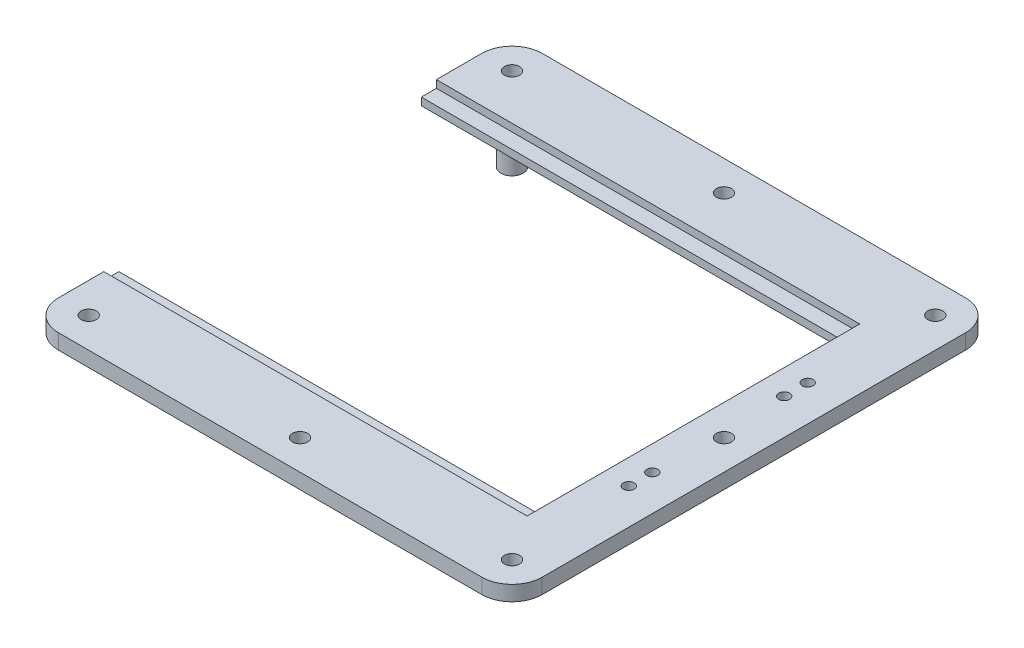
ISO-10303-21;
HEADER;
FILE_DESCRIPTION(('STEP AP214'),'2;1');
FILE_NAME('part.step','',(''),(''),'','','');
FILE_SCHEMA(('AUTOMOTIVE_DESIGN { 1 0 10303 214 1 1 1 1 }'));
ENDSEC;
DATA;
#1=APPLICATION_CONTEXT('core data for automotive mechanical design processes');
#2=APPLICATION_PROTOCOL_DEFINITION('international standard','automotive_design',2000,#1);
#3=PRODUCT_CONTEXT('',#1,'mechanical');
#4=PRODUCT('Part','Part','',(#3));
#5=PRODUCT_RELATED_PRODUCT_CATEGORY('part','',(#4));
#6=PRODUCT_DEFINITION_FORMATION('','',#4);
#7=PRODUCT_DEFINITION_CONTEXT('part definition',#1,'design');
#8=PRODUCT_DEFINITION('design','',#6,#7);
#9=PRODUCT_DEFINITION_SHAPE('','',#8);
#10=(LENGTH_UNIT() NAMED_UNIT(*) SI_UNIT(.MILLI.,.METRE.));
#11=(NAMED_UNIT(*) PLANE_ANGLE_UNIT() SI_UNIT($,.RADIAN.));
#12=(NAMED_UNIT(*) SI_UNIT($,.STERADIAN.) SOLID_ANGLE_UNIT());
#13=UNCERTAINTY_MEASURE_WITH_UNIT(LENGTH_MEASURE(1.E-05),#10,'distance_accuracy_value','');
#14=(GEOMETRIC_REPRESENTATION_CONTEXT(3) GLOBAL_UNCERTAINTY_ASSIGNED_CONTEXT((#13)) GLOBAL_UNIT_ASSIGNED_CONTEXT((#10,
#11,#12)) REPRESENTATION_CONTEXT('',''));
#15=CARTESIAN_POINT('',(0.,0.,0.));
#16=DIRECTION('',(0.,0.,1.));
#17=DIRECTION('',(1.,0.,0.));
#18=AXIS2_PLACEMENT_3D('',#15,#16,#17);
#19=CARTESIAN_POINT('',(177.8,6.35,0.));
#20=DIRECTION('',(0.,0.,-1.));
#21=DIRECTION('',(-1.,0.,0.));
#22=AXIS2_PLACEMENT_3D('',#19,#20,#21);
#23=PLANE('',#22);
#24=DIRECTION('',(0.,-1.,0.));
#25=VECTOR('',#24,1.);
#26=CARTESIAN_POINT('',(177.8,6.35,0.));
#27=LINE('',#26,#25);
#28=CARTESIAN_POINT('',(177.8,3.175,0.));
#29=VERTEX_POINT('',#28);
#30=CARTESIAN_POINT('',(177.8,0.,0.));
#31=VERTEX_POINT('',#30);
#32=EDGE_CURVE('E11',#29,#31,#27,.T.);
#33=ORIENTED_EDGE('',*,*,#32,.F.);
#34=DIRECTION('',(1.,0.,0.));
#35=VECTOR('',#34,1.);
#36=CARTESIAN_POINT('',(177.8,3.175,0.));
#37=LINE('',#36,#35);
#38=CARTESIAN_POINT('',(1.08197495753343E-13,3.175,0.));
#39=VERTEX_POINT('',#38);
#40=EDGE_CURVE('E310',#39,#29,#37,.T.);
#41=ORIENTED_EDGE('',*,*,#40,.F.);
#42=DIRECTION('',(0.,-1.,0.));
#43=VECTOR('',#42,1.);
#44=CARTESIAN_POINT('',(0.,6.35,0.));
#45=LINE('',#44,#43);
#46=CARTESIAN_POINT('',(0.,0.,0.));
#47=VERTEX_POINT('',#46);
#48=EDGE_CURVE('E109',#39,#47,#45,.T.);
#49=ORIENTED_EDGE('',*,*,#48,.T.);
#50=DIRECTION('',(1.,0.,0.));
#51=VECTOR('',#50,1.);
#52=CARTESIAN_POINT('',(177.8,0.,0.));
#53=LINE('',#52,#51);
#54=EDGE_CURVE('E169',#47,#31,#53,.T.);
#55=ORIENTED_EDGE('',*,*,#54,.T.);
#56=EDGE_LOOP('',(#33,#41,#49,#55));
#57=FACE_BOUND('',#56,.T.);
#58=ADVANCED_FACE('F38',(#57),#23,.F.);
#59=CARTESIAN_POINT('',(177.8,6.35,127.));
#60=DIRECTION('',(1.,0.,0.));
#61=DIRECTION('',(0.,0.,-1.));
#62=AXIS2_PLACEMENT_3D('',#59,#60,#61);
#63=PLANE('',#62);
#64=DIRECTION('',(0.,0.,1.));
#65=VECTOR('',#64,1.);
#66=CARTESIAN_POINT('',(177.8,0.,127.));
#67=LINE('',#66,#65);
#68=CARTESIAN_POINT('',(177.8,0.,127.));
#69=VERTEX_POINT('',#68);
#70=EDGE_CURVE('E172',#31,#69,#67,.T.);
#71=ORIENTED_EDGE('',*,*,#70,.T.);
#72=DIRECTION('',(0.,-1.,0.));
#73=VECTOR('',#72,1.);
#74=CARTESIAN_POINT('',(177.8,6.35,127.));
#75=LINE('',#74,#73);
#76=CARTESIAN_POINT('',(177.8,3.175,127.));
#77=VERTEX_POINT('',#76);
#78=EDGE_CURVE('E47',#77,#69,#75,.T.);
#79=ORIENTED_EDGE('',*,*,#78,.F.);
#80=DIRECTION('',(0.,0.,-1.));
#81=VECTOR('',#80,1.);
#82=CARTESIAN_POINT('',(177.8,3.175,127.));
#83=LINE('',#82,#81);
#84=CARTESIAN_POINT('',(177.8,3.175,133.35));
#85=VERTEX_POINT('',#84);
#86=EDGE_CURVE('E283',#85,#77,#83,.T.);
#87=ORIENTED_EDGE('',*,*,#86,.F.);
#88=DIRECTION('',(0.,1.,0.));
#89=VECTOR('',#88,1.);
#90=CARTESIAN_POINT('',(177.8,3.175,133.35));
#91=LINE('',#90,#89);
#92=CARTESIAN_POINT('',(177.8,6.35,133.35));
#93=VERTEX_POINT('',#92);
#94=EDGE_CURVE('E303',#85,#93,#91,.T.);
#95=ORIENTED_EDGE('',*,*,#94,.T.);
#96=DIRECTION('',(0.,0.,1.));
#97=VECTOR('',#96,1.);
#98=CARTESIAN_POINT('',(177.8,6.35,127.));
#99=LINE('',#98,#97);
#100=CARTESIAN_POINT('',(177.8,6.35,-6.35000000000002));
#101=VERTEX_POINT('',#100);
#102=EDGE_CURVE('E207',#101,#93,#99,.T.);
#103=ORIENTED_EDGE('',*,*,#102,.F.);
#104=DIRECTION('',(0.,1.,0.));
#105=VECTOR('',#104,1.);
#106=CARTESIAN_POINT('',(177.8,3.175,-6.35000000000002));
#107=LINE('',#106,#105);
#108=CARTESIAN_POINT('',(177.8,3.175,-6.35000000000002));
#109=VERTEX_POINT('',#108);
#110=EDGE_CURVE('E326',#109,#101,#107,.T.);
#111=ORIENTED_EDGE('',*,*,#110,.F.);
#112=DIRECTION('',(0.,0.,-1.));
#113=VECTOR('',#112,1.);
#114=CARTESIAN_POINT('',(177.8,3.175,0.));
#115=LINE('',#114,#113);
#116=EDGE_CURVE('E314',#29,#109,#115,.T.);
#117=ORIENTED_EDGE('',*,*,#116,.F.);
#118=ORIENTED_EDGE('',*,*,#32,.T.);
#119=EDGE_LOOP('',(#71,#79,#87,#95,#103,#111,#117,#118));
#120=FACE_BOUND('',#119,.T.);
#121=ADVANCED_FACE('F474',(#120),#63,.F.);
#122=CARTESIAN_POINT('',(0.,6.35,127.));
#123=DIRECTION('',(0.,0.,1.));
#124=DIRECTION('',(1.,0.,0.));
#125=AXIS2_PLACEMENT_3D('',#122,#123,#124);
#126=PLANE('',#125);
#127=DIRECTION('',(0.,-1.,0.));
#128=VECTOR('',#127,1.);
#129=CARTESIAN_POINT('',(0.,6.35,127.));
#130=LINE('',#129,#128);
#131=CARTESIAN_POINT('',(0.,3.175,127.));
#132=VERTEX_POINT('',#131);
#133=CARTESIAN_POINT('',(0.,0.,127.));
#134=VERTEX_POINT('',#133);
#135=EDGE_CURVE('E234',#132,#134,#130,.T.);
#136=ORIENTED_EDGE('',*,*,#135,.F.);
#137=DIRECTION('',(-1.,0.,0.));
#138=VECTOR('',#137,1.);
#139=CARTESIAN_POINT('',(177.8,3.175,127.));
#140=LINE('',#139,#138);
#141=EDGE_CURVE('E287',#77,#132,#140,.T.);
#142=ORIENTED_EDGE('',*,*,#141,.F.);
#143=ORIENTED_EDGE('',*,*,#78,.T.);
#144=DIRECTION('',(-1.,0.,0.));
#145=VECTOR('',#144,1.);
#146=CARTESIAN_POINT('',(0.,0.,127.));
#147=LINE('',#146,#145);
#148=EDGE_CURVE('E177',#69,#134,#147,.T.);
#149=ORIENTED_EDGE('',*,*,#148,.T.);
#150=EDGE_LOOP('',(#136,#142,#143,#149));
#151=FACE_BOUND('',#150,.T.);
#152=ADVANCED_FACE('F478',(#151),#126,.F.);
#153=CARTESIAN_POINT('',(0.,6.35,152.4));
#154=DIRECTION('',(1.,0.,0.));
#155=DIRECTION('',(0.,0.,-1.));
#156=AXIS2_PLACEMENT_3D('',#153,#154,#155);
#157=PLANE('',#156);
#158=DIRECTION('',(0.,0.,1.));
#159=VECTOR('',#158,1.);
#160=CARTESIAN_POINT('',(0.,6.35,152.4));
#161=LINE('',#160,#159);
#162=CARTESIAN_POINT('',(0.,6.35,133.35));
#163=VERTEX_POINT('',#162);
#164=CARTESIAN_POINT('',(0.,6.35,152.4));
#165=VERTEX_POINT('',#164);
#166=EDGE_CURVE('E116',#163,#165,#161,.T.);
#167=ORIENTED_EDGE('',*,*,#166,.F.);
#168=DIRECTION('',(0.,1.,0.));
#169=VECTOR('',#168,1.);
#170=CARTESIAN_POINT('',(0.,3.175,133.35));
#171=LINE('',#170,#169);
#172=CARTESIAN_POINT('',(0.,3.175,133.35));
#173=VERTEX_POINT('',#172);
#174=EDGE_CURVE('E55',#173,#163,#171,.T.);
#175=ORIENTED_EDGE('',*,*,#174,.F.);
#176=DIRECTION('',(0.,0.,1.));
#177=VECTOR('',#176,1.);
#178=CARTESIAN_POINT('',(0.,3.175,127.));
#179=LINE('',#178,#177);
#180=EDGE_CURVE('E292',#132,#173,#179,.T.);
#181=ORIENTED_EDGE('',*,*,#180,.F.);
#182=ORIENTED_EDGE('',*,*,#135,.T.);
#183=DIRECTION('',(0.,0.,1.));
#184=VECTOR('',#183,1.);
#185=CARTESIAN_POINT('',(0.,0.,152.4));
#186=LINE('',#185,#184);
#187=CARTESIAN_POINT('',(0.,0.,152.4));
#188=VERTEX_POINT('',#187);
#189=EDGE_CURVE('E181',#134,#188,#186,.T.);
#190=ORIENTED_EDGE('',*,*,#189,.T.);
#191=DIRECTION('',(0.,-1.,0.));
#192=VECTOR('',#191,1.);
#193=CARTESIAN_POINT('',(0.,6.35,152.4));
#194=LINE('',#193,#192);
#195=EDGE_CURVE('E230',#165,#188,#194,.T.);
#196=ORIENTED_EDGE('',*,*,#195,.F.);
#197=EDGE_LOOP('',(#167,#175,#181,#182,#190,#196));
#198=FACE_BOUND('',#197,.T.);
#199=ADVANCED_FACE('F805',(#198),#157,.F.);
#200=CARTESIAN_POINT('',(12.7,6.35,152.4));
#201=DIRECTION('',(0.,-1.,0.));
#202=DIRECTION('',(0.,0.,-1.));
#203=AXIS2_PLACEMENT_3D('',#200,#201,#202);
#204=CYLINDRICAL_SURFACE('',#203,12.7);
#205=CARTESIAN_POINT('',(12.7,0.,152.4));
#206=DIRECTION('',(0.,1.,0.));
#207=DIRECTION('',(0.,0.,-1.));
#208=AXIS2_PLACEMENT_3D('',#205,#206,#207);
#209=CIRCLE('',#208,12.7);
#210=CARTESIAN_POINT('',(12.7000000000001,0.,165.1));
#211=VERTEX_POINT('',#210);
#212=EDGE_CURVE('E184',#188,#211,#209,.T.);
#213=ORIENTED_EDGE('',*,*,#212,.T.);
#214=DIRECTION('',(0.,-1.,0.));
#215=VECTOR('',#214,1.);
#216=CARTESIAN_POINT('',(12.7000000000001,6.35,165.1));
#217=LINE('',#216,#215);
#218=CARTESIAN_POINT('',(12.7000000000001,6.35,165.1));
#219=VERTEX_POINT('',#218);
#220=EDGE_CURVE('E226',#219,#211,#217,.T.);
#221=ORIENTED_EDGE('',*,*,#220,.F.);
#222=CARTESIAN_POINT('',(12.7,6.35,152.4));
#223=DIRECTION('',(0.,1.,0.));
#224=DIRECTION('',(0.,0.,-1.));
#225=AXIS2_PLACEMENT_3D('',#222,#223,#224);
#226=CIRCLE('',#225,12.7);
#227=EDGE_CURVE('E402',#165,#219,#226,.T.);
#228=ORIENTED_EDGE('',*,*,#227,.F.);
#229=ORIENTED_EDGE('',*,*,#195,.T.);
#230=EDGE_LOOP('',(#213,#221,#228,#229));
#231=FACE_BOUND('',#230,.T.);
#232=ADVANCED_FACE('F813',(#231),#204,.T.);
#233=CARTESIAN_POINT('',(190.5,6.35,165.1));
#234=DIRECTION('',(0.,0.,-1.));
#235=DIRECTION('',(-1.,0.,0.));
#236=AXIS2_PLACEMENT_3D('',#233,#234,#235);
#237=PLANE('',#236);
#238=DIRECTION('',(1.,0.,0.));
#239=VECTOR('',#238,1.);
#240=CARTESIAN_POINT('',(190.5,0.,165.1));
#241=LINE('',#240,#239);
#242=CARTESIAN_POINT('',(190.5,0.,165.1));
#243=VERTEX_POINT('',#242);
#244=EDGE_CURVE('E187',#211,#243,#241,.T.);
#245=ORIENTED_EDGE('',*,*,#244,.T.);
#246=DIRECTION('',(0.,-1.,0.));
#247=VECTOR('',#246,1.);
#248=CARTESIAN_POINT('',(190.5,6.35,165.1));
#249=LINE('',#248,#247);
#250=CARTESIAN_POINT('',(190.5,6.35,165.1));
#251=VERTEX_POINT('',#250);
#252=EDGE_CURVE('E222',#251,#243,#249,.T.);
#253=ORIENTED_EDGE('',*,*,#252,.F.);
#254=DIRECTION('',(1.,0.,0.));
#255=VECTOR('',#254,1.);
#256=CARTESIAN_POINT('',(190.5,6.35,165.1));
#257=LINE('',#256,#255);
#258=EDGE_CURVE('E405',#219,#251,#257,.T.);
#259=ORIENTED_EDGE('',*,*,#258,.F.);
#260=ORIENTED_EDGE('',*,*,#220,.T.);
#261=EDGE_LOOP('',(#245,#253,#259,#260));
#262=FACE_BOUND('',#261,.T.);
#263=ADVANCED_FACE('F824',(#262),#237,.F.);
#264=CARTESIAN_POINT('',(190.5,6.35,152.4));
#265=DIRECTION('',(0.,-1.,0.));
#266=DIRECTION('',(0.,0.,-1.));
#267=AXIS2_PLACEMENT_3D('',#264,#265,#266);
#268=CYLINDRICAL_SURFACE('',#267,12.7);
#269=CARTESIAN_POINT('',(190.5,0.,152.4));
#270=DIRECTION('',(0.,1.,0.));
#271=DIRECTION('',(0.,0.,-1.));
#272=AXIS2_PLACEMENT_3D('',#269,#270,#271);
#273=CIRCLE('',#272,12.7);
#274=CARTESIAN_POINT('',(203.2,0.,152.4));
#275=VERTEX_POINT('',#274);
#276=EDGE_CURVE('E190',#243,#275,#273,.T.);
#277=ORIENTED_EDGE('',*,*,#276,.T.);
#278=DIRECTION('',(0.,-1.,0.));
#279=VECTOR('',#278,1.);
#280=CARTESIAN_POINT('',(203.2,6.35,152.4));
#281=LINE('',#280,#279);
#282=CARTESIAN_POINT('',(203.2,6.35,152.4));
#283=VERTEX_POINT('',#282);
#284=EDGE_CURVE('E218',#283,#275,#281,.T.);
#285=ORIENTED_EDGE('',*,*,#284,.F.);
#286=CARTESIAN_POINT('',(190.5,6.35,152.4));
#287=DIRECTION('',(0.,1.,0.));
#288=DIRECTION('',(0.,0.,-1.));
#289=AXIS2_PLACEMENT_3D('',#286,#287,#288);
#290=CIRCLE('',#289,12.7);
#291=EDGE_CURVE('E408',#251,#283,#290,.T.);
#292=ORIENTED_EDGE('',*,*,#291,.F.);
#293=ORIENTED_EDGE('',*,*,#252,.T.);
#294=EDGE_LOOP('',(#277,#285,#292,#293));
#295=FACE_BOUND('',#294,.T.);
#296=ADVANCED_FACE('F831',(#295),#268,.T.);
#297=CARTESIAN_POINT('',(203.2,6.35,-25.3999999999999));
#298=DIRECTION('',(-1.,0.,0.));
#299=DIRECTION('',(0.,0.,1.));
#300=AXIS2_PLACEMENT_3D('',#297,#298,#299);
#301=PLANE('',#300);
#302=DIRECTION('',(0.,0.,-1.));
#303=VECTOR('',#302,1.);
#304=CARTESIAN_POINT('',(203.2,0.,-25.3999999999999));
#305=LINE('',#304,#303);
#306=CARTESIAN_POINT('',(203.2,0.,-25.3999999999999));
#307=VERTEX_POINT('',#306);
#308=EDGE_CURVE('E193',#275,#307,#305,.T.);
#309=ORIENTED_EDGE('',*,*,#308,.T.);
#310=DIRECTION('',(0.,-1.,0.));
#311=VECTOR('',#310,1.);
#312=CARTESIAN_POINT('',(203.2,6.35,-25.3999999999999));
#313=LINE('',#312,#311);
#314=CARTESIAN_POINT('',(203.2,6.35,-25.3999999999999));
#315=VERTEX_POINT('',#314);
#316=EDGE_CURVE('E155',#315,#307,#313,.T.);
#317=ORIENTED_EDGE('',*,*,#316,.F.);
#318=DIRECTION('',(0.,0.,-1.));
#319=VECTOR('',#318,1.);
#320=CARTESIAN_POINT('',(203.2,6.35,-25.3999999999999));
#321=LINE('',#320,#319);
#322=EDGE_CURVE('E141',#283,#315,#321,.T.);
#323=ORIENTED_EDGE('',*,*,#322,.F.);
#324=ORIENTED_EDGE('',*,*,#284,.T.);
#325=EDGE_LOOP('',(#309,#317,#323,#324));
#326=FACE_BOUND('',#325,.T.);
#327=ADVANCED_FACE('F839',(#326),#301,.F.);
#328=CARTESIAN_POINT('',(190.5,6.35,-25.4));
#329=DIRECTION('',(0.,-1.,0.));
#330=DIRECTION('',(0.,0.,-1.));
#331=AXIS2_PLACEMENT_3D('',#328,#329,#330);
#332=CYLINDRICAL_SURFACE('',#331,12.7);
#333=CARTESIAN_POINT('',(190.5,0.,-25.4));
#334=DIRECTION('',(0.,1.,0.));
#335=DIRECTION('',(0.,0.,-1.));
#336=AXIS2_PLACEMENT_3D('',#333,#334,#335);
#337=CIRCLE('',#336,12.7);
#338=CARTESIAN_POINT('',(190.5,0.,-38.1));
#339=VERTEX_POINT('',#338);
#340=EDGE_CURVE('E151',#307,#339,#337,.T.);
#341=ORIENTED_EDGE('',*,*,#340,.T.);
#342=DIRECTION('',(0.,-1.,0.));
#343=VECTOR('',#342,1.);
#344=CARTESIAN_POINT('',(190.5,6.35,-38.1));
#345=LINE('',#344,#343);
#346=CARTESIAN_POINT('',(190.5,6.35,-38.1));
#347=VERTEX_POINT('',#346);
#348=EDGE_CURVE('E148',#347,#339,#345,.T.);
#349=ORIENTED_EDGE('',*,*,#348,.F.);
#350=CARTESIAN_POINT('',(190.5,6.35,-25.4));
#351=DIRECTION('',(0.,1.,0.));
#352=DIRECTION('',(0.,0.,-1.));
#353=AXIS2_PLACEMENT_3D('',#350,#351,#352);
#354=CIRCLE('',#353,12.7);
#355=EDGE_CURVE('E133',#315,#347,#354,.T.);
#356=ORIENTED_EDGE('',*,*,#355,.F.);
#357=ORIENTED_EDGE('',*,*,#316,.T.);
#358=EDGE_LOOP('',(#341,#349,#356,#357));
#359=FACE_BOUND('',#358,.T.);
#360=ADVANCED_FACE('F149',(#359),#332,.T.);
#361=CARTESIAN_POINT('',(12.7000000000001,6.35,-38.1));
#362=DIRECTION('',(0.,0.,1.));
#363=DIRECTION('',(1.,0.,0.));
#364=AXIS2_PLACEMENT_3D('',#361,#362,#363);
#365=PLANE('',#364);
#366=DIRECTION('',(-1.,0.,0.));
#367=VECTOR('',#366,1.);
#368=CARTESIAN_POINT('',(12.7000000000001,0.,-38.1));
#369=LINE('',#368,#367);
#370=CARTESIAN_POINT('',(12.7,0.,-38.1));
#371=VERTEX_POINT('',#370);
#372=EDGE_CURVE('E198',#339,#371,#369,.T.);
#373=ORIENTED_EDGE('',*,*,#372,.T.);
#374=DIRECTION('',(0.,-1.,0.));
#375=VECTOR('',#374,1.);
#376=CARTESIAN_POINT('',(12.7,6.35,-38.1));
#377=LINE('',#376,#375);
#378=CARTESIAN_POINT('',(12.7,6.35,-38.1));
#379=VERTEX_POINT('',#378);
#380=EDGE_CURVE('E156',#379,#371,#377,.T.);
#381=ORIENTED_EDGE('',*,*,#380,.F.);
#382=DIRECTION('',(-1.,0.,0.));
#383=VECTOR('',#382,1.);
#384=CARTESIAN_POINT('',(12.7000000000001,6.35,-38.1));
#385=LINE('',#384,#383);
#386=EDGE_CURVE('E138',#347,#379,#385,.T.);
#387=ORIENTED_EDGE('',*,*,#386,.F.);
#388=ORIENTED_EDGE('',*,*,#348,.T.);
#389=EDGE_LOOP('',(#373,#381,#387,#388));
#390=FACE_BOUND('',#389,.T.);
#391=ADVANCED_FACE('F158',(#390),#365,.F.);
#392=CARTESIAN_POINT('',(12.7,6.35,-25.4));
#393=DIRECTION('',(0.,-1.,0.));
#394=DIRECTION('',(0.,0.,-1.));
#395=AXIS2_PLACEMENT_3D('',#392,#393,#394);
#396=CYLINDRICAL_SURFACE('',#395,12.7);
#397=CARTESIAN_POINT('',(12.7,0.,-25.4));
#398=DIRECTION('',(0.,1.,0.));
#399=DIRECTION('',(0.,0.,-1.));
#400=AXIS2_PLACEMENT_3D('',#397,#398,#399);
#401=CIRCLE('',#400,12.7);
#402=CARTESIAN_POINT('',(0.,0.,-25.3999999999999));
#403=VERTEX_POINT('',#402);
#404=EDGE_CURVE('E201',#371,#403,#401,.T.);
#405=ORIENTED_EDGE('',*,*,#404,.T.);
#406=DIRECTION('',(0.,-1.,0.));
#407=VECTOR('',#406,1.);
#408=CARTESIAN_POINT('',(0.,6.35,-25.3999999999999));
#409=LINE('',#408,#407);
#410=CARTESIAN_POINT('',(0.,6.35,-25.3999999999999));
#411=VERTEX_POINT('',#410);
#412=EDGE_CURVE('E210',#411,#403,#409,.T.);
#413=ORIENTED_EDGE('',*,*,#412,.F.);
#414=CARTESIAN_POINT('',(12.7,6.35,-25.4));
#415=DIRECTION('',(0.,1.,0.));
#416=DIRECTION('',(0.,0.,-1.));
#417=AXIS2_PLACEMENT_3D('',#414,#415,#416);
#418=CIRCLE('',#417,12.7);
#419=EDGE_CURVE('E64',#379,#411,#418,.T.);
#420=ORIENTED_EDGE('',*,*,#419,.F.);
#421=ORIENTED_EDGE('',*,*,#380,.T.);
#422=EDGE_LOOP('',(#405,#413,#420,#421));
#423=FACE_BOUND('',#422,.T.);
#424=ADVANCED_FACE('F860',(#423),#396,.T.);
#425=CARTESIAN_POINT('',(0.,6.35,0.));
#426=DIRECTION('',(1.,0.,0.));
#427=DIRECTION('',(0.,0.,-1.));
#428=AXIS2_PLACEMENT_3D('',#425,#426,#427);
#429=PLANE('',#428);
#430=DIRECTION('',(0.,0.,1.));
#431=VECTOR('',#430,1.);
#432=CARTESIAN_POINT('',(1.08197495753343E-13,3.175,0.));
#433=LINE('',#432,#431);
#434=CARTESIAN_POINT('',(1.06356398157764E-13,3.175,-6.35000000000005));
#435=VERTEX_POINT('',#434);
#436=EDGE_CURVE('E322',#435,#39,#433,.T.);
#437=ORIENTED_EDGE('',*,*,#436,.F.);
#438=DIRECTION('',(0.,1.,0.));
#439=VECTOR('',#438,1.);
#440=CARTESIAN_POINT('',(1.06356398157764E-13,3.175,-6.35000000000005));
#441=LINE('',#440,#439);
#442=CARTESIAN_POINT('',(1.06356398157764E-13,6.35,-6.35000000000005));
#443=VERTEX_POINT('',#442);
#444=EDGE_CURVE('E302',#435,#443,#441,.T.);
#445=ORIENTED_EDGE('',*,*,#444,.T.);
#446=DIRECTION('',(0.,0.,1.));
#447=VECTOR('',#446,1.);
#448=CARTESIAN_POINT('',(0.,6.35,0.));
#449=LINE('',#448,#447);
#450=EDGE_CURVE('E163',#411,#443,#449,.T.);
#451=ORIENTED_EDGE('',*,*,#450,.F.);
#452=ORIENTED_EDGE('',*,*,#412,.T.);
#453=DIRECTION('',(0.,0.,1.));
#454=VECTOR('',#453,1.);
#455=CARTESIAN_POINT('',(0.,0.,0.));
#456=LINE('',#455,#454);
#457=EDGE_CURVE('E204',#403,#47,#456,.T.);
#458=ORIENTED_EDGE('',*,*,#457,.T.);
#459=ORIENTED_EDGE('',*,*,#48,.F.);
#460=EDGE_LOOP('',(#437,#445,#451,#452,#458,#459));
#461=FACE_BOUND('',#460,.T.);
#462=ADVANCED_FACE('F436',(#461),#429,.F.);
#463=CARTESIAN_POINT('',(12.7,6.35,-25.4));
#464=DIRECTION('',(0.,-1.,0.));
#465=DIRECTION('',(0.,0.,-1.));
#466=AXIS2_PLACEMENT_3D('',#463,#464,#465);
#467=PLANE('',#466);
#468=CARTESIAN_POINT('',(101.6,6.35,-25.527));
#469=DIRECTION('',(0.,1.,0.));
#470=DIRECTION('',(0.,0.,1.));
#471=AXIS2_PLACEMENT_3D('',#468,#469,#470);
#472=CIRCLE('',#471,3.175);
#473=CARTESIAN_POINT('',(101.6,6.35,-22.352));
#474=VERTEX_POINT('',#473);
#475=EDGE_CURVE('E261',#474,#474,#472,.T.);
#476=ORIENTED_EDGE('',*,*,#475,.F.);
#477=EDGE_LOOP('',(#476));
#478=FACE_BOUND('',#477,.T.);
#479=CARTESIAN_POINT('',(190.627000000001,6.35,63.4999999999985));
#480=DIRECTION('',(0.,1.,0.));
#481=DIRECTION('',(0.,0.,1.));
#482=AXIS2_PLACEMENT_3D('',#479,#480,#481);
#483=CIRCLE('',#482,3.17499999999997);
#484=CARTESIAN_POINT('',(190.627000000001,6.35,66.6749999999985));
#485=VERTEX_POINT('',#484);
#486=EDGE_CURVE('E423',#485,#485,#483,.T.);
#487=ORIENTED_EDGE('',*,*,#486,.F.);
#488=EDGE_LOOP('',(#487));
#489=FACE_BOUND('',#488,.T.);
#490=CARTESIAN_POINT('',(101.600000000003,6.35,152.527));
#491=DIRECTION('',(0.,1.,0.));
#492=DIRECTION('',(0.,0.,1.));
#493=AXIS2_PLACEMENT_3D('',#490,#491,#492);
#494=CIRCLE('',#493,3.175);
#495=CARTESIAN_POINT('',(101.600000000003,6.35,155.702));
#496=VERTEX_POINT('',#495);
#497=EDGE_CURVE('E419',#496,#496,#494,.T.);
#498=ORIENTED_EDGE('',*,*,#497,.F.);
#499=EDGE_LOOP('',(#498));
#500=FACE_BOUND('',#499,.T.);
#501=CARTESIAN_POINT('',(188.214,6.35,101.092));
#502=DIRECTION('',(0.,1.,0.));
#503=DIRECTION('',(0.,0.,1.));
#504=AXIS2_PLACEMENT_3D('',#501,#502,#503);
#505=CIRCLE('',#504,2.28600000000001);
#506=CARTESIAN_POINT('',(188.214,6.35,103.378));
#507=VERTEX_POINT('',#506);
#508=EDGE_CURVE('E244',#507,#507,#505,.T.);
#509=ORIENTED_EDGE('',*,*,#508,.F.);
#510=EDGE_LOOP('',(#509));
#511=FACE_BOUND('',#510,.T.);
#512=CARTESIAN_POINT('',(188.214,6.35,91.186));
#513=DIRECTION('',(0.,1.,0.));
#514=DIRECTION('',(0.,0.,1.));
#515=AXIS2_PLACEMENT_3D('',#512,#513,#514);
#516=CIRCLE('',#515,2.28600000000001);
#517=CARTESIAN_POINT('',(188.214,6.35,93.472));
#518=VERTEX_POINT('',#517);
#519=EDGE_CURVE('E279',#518,#518,#516,.T.);
#520=ORIENTED_EDGE('',*,*,#519,.F.);
#521=EDGE_LOOP('',(#520));
#522=FACE_BOUND('',#521,.T.);
#523=CARTESIAN_POINT('',(188.214,6.35,35.814));
#524=DIRECTION('',(0.,1.,0.));
#525=DIRECTION('',(0.,0.,1.));
#526=AXIS2_PLACEMENT_3D('',#523,#524,#525);
#527=CIRCLE('',#526,2.28600000000001);
#528=CARTESIAN_POINT('',(188.214,6.35,38.1));
#529=VERTEX_POINT('',#528);
#530=EDGE_CURVE('E273',#529,#529,#527,.T.);
#531=ORIENTED_EDGE('',*,*,#530,.F.);
#532=EDGE_LOOP('',(#531));
#533=FACE_BOUND('',#532,.T.);
#534=CARTESIAN_POINT('',(188.214,6.35,25.908));
#535=DIRECTION('',(0.,1.,0.));
#536=DIRECTION('',(0.,0.,1.));
#537=AXIS2_PLACEMENT_3D('',#534,#535,#536);
#538=CIRCLE('',#537,2.28600000000001);
#539=CARTESIAN_POINT('',(188.214,6.35,28.194));
#540=VERTEX_POINT('',#539);
#541=EDGE_CURVE('E268',#540,#540,#538,.T.);
#542=ORIENTED_EDGE('',*,*,#541,.F.);
#543=EDGE_LOOP('',(#542));
#544=FACE_BOUND('',#543,.T.);
#545=CARTESIAN_POINT('',(12.7,6.35,152.4));
#546=DIRECTION('',(0.,1.,0.));
#547=DIRECTION('',(0.,0.,1.));
#548=AXIS2_PLACEMENT_3D('',#545,#546,#547);
#549=CIRCLE('',#548,3.175);
#550=CARTESIAN_POINT('',(12.7,6.35,155.575));
#551=VERTEX_POINT('',#550);
#552=EDGE_CURVE('E364',#551,#551,#549,.T.);
#553=ORIENTED_EDGE('',*,*,#552,.F.);
#554=EDGE_LOOP('',(#553));
#555=FACE_BOUND('',#554,.T.);
#556=CARTESIAN_POINT('',(190.5,6.35,152.4));
#557=DIRECTION('',(0.,1.,0.));
#558=DIRECTION('',(0.,0.,1.));
#559=AXIS2_PLACEMENT_3D('',#556,#557,#558);
#560=CIRCLE('',#559,3.175);
#561=CARTESIAN_POINT('',(190.5,6.35,155.575));
#562=VERTEX_POINT('',#561);
#563=EDGE_CURVE('E381',#562,#562,#560,.T.);
#564=ORIENTED_EDGE('',*,*,#563,.F.);
#565=EDGE_LOOP('',(#564));
#566=FACE_BOUND('',#565,.T.);
#567=CARTESIAN_POINT('',(190.5,6.35,-25.4));
#568=DIRECTION('',(0.,1.,0.));
#569=DIRECTION('',(0.,0.,1.));
#570=AXIS2_PLACEMENT_3D('',#567,#568,#569);
#571=CIRCLE('',#570,3.175);
#572=CARTESIAN_POINT('',(190.5,6.35,-22.225));
#573=VERTEX_POINT('',#572);
#574=EDGE_CURVE('E373',#573,#573,#571,.T.);
#575=ORIENTED_EDGE('',*,*,#574,.F.);
#576=EDGE_LOOP('',(#575));
#577=FACE_BOUND('',#576,.T.);
#578=CARTESIAN_POINT('',(12.7,6.35,-25.4));
#579=DIRECTION('',(0.,1.,0.));
#580=DIRECTION('',(0.,0.,1.));
#581=AXIS2_PLACEMENT_3D('',#578,#579,#580);
#582=CIRCLE('',#581,3.175);
#583=CARTESIAN_POINT('',(12.7,6.35,-22.225));
#584=VERTEX_POINT('',#583);
#585=EDGE_CURVE('E372',#584,#584,#582,.T.);
#586=ORIENTED_EDGE('',*,*,#585,.F.);
#587=EDGE_LOOP('',(#586));
#588=FACE_BOUND('',#587,.T.);
#589=ORIENTED_EDGE('',*,*,#102,.T.);
#590=DIRECTION('',(1.,0.,0.));
#591=VECTOR('',#590,1.);
#592=CARTESIAN_POINT('',(177.8,6.35,133.35));
#593=LINE('',#592,#591);
#594=EDGE_CURVE('E288',#163,#93,#593,.T.);
#595=ORIENTED_EDGE('',*,*,#594,.F.);
#596=ORIENTED_EDGE('',*,*,#166,.T.);
#597=ORIENTED_EDGE('',*,*,#227,.T.);
#598=ORIENTED_EDGE('',*,*,#258,.T.);
#599=ORIENTED_EDGE('',*,*,#291,.T.);
#600=ORIENTED_EDGE('',*,*,#322,.T.);
#601=ORIENTED_EDGE('',*,*,#355,.T.);
#602=ORIENTED_EDGE('',*,*,#386,.T.);
#603=ORIENTED_EDGE('',*,*,#419,.T.);
#604=ORIENTED_EDGE('',*,*,#450,.T.);
#605=DIRECTION('',(-1.,0.,0.));
#606=VECTOR('',#605,1.);
#607=CARTESIAN_POINT('',(177.8,6.35,-6.35000000000002));
#608=LINE('',#607,#606);
#609=EDGE_CURVE('E256',#101,#443,#608,.T.);
#610=ORIENTED_EDGE('',*,*,#609,.F.);
#611=EDGE_LOOP('',(#589,#595,#596,#597,#598,#599,#600,#601,#602,#603,#604,#610));
#612=FACE_BOUND('',#611,.T.);
#613=ADVANCED_FACE('F136',(#478,#489,#500,#511,#522,#533,#544,#555,#566,#577,#588,#612),#467,.F.);
#614=CARTESIAN_POINT('',(12.7,0.,-25.4));
#615=DIRECTION('',(0.,-1.,0.));
#616=DIRECTION('',(0.,0.,-1.));
#617=AXIS2_PLACEMENT_3D('',#614,#615,#616);
#618=PLANE('',#617);
#619=CARTESIAN_POINT('',(101.6,0.,-25.527));
#620=DIRECTION('',(0.,-1.,0.));
#621=DIRECTION('',(0.,0.,-1.));
#622=AXIS2_PLACEMENT_3D('',#619,#620,#621);
#623=CIRCLE('',#622,3.175);
#624=CARTESIAN_POINT('',(101.6,0.,-28.702));
#625=VERTEX_POINT('',#624);
#626=EDGE_CURVE('E41',#625,#625,#623,.T.);
#627=ORIENTED_EDGE('',*,*,#626,.F.);
#628=EDGE_LOOP('',(#627));
#629=FACE_BOUND('',#628,.T.);
#630=CARTESIAN_POINT('',(190.627000000001,0.,63.4999999999985));
#631=DIRECTION('',(0.,-1.,0.));
#632=DIRECTION('',(0.,0.,-1.));
#633=AXIS2_PLACEMENT_3D('',#630,#631,#632);
#634=CIRCLE('',#633,3.17499999999997);
#635=CARTESIAN_POINT('',(190.627000000001,0.,60.3249999999986));
#636=VERTEX_POINT('',#635);
#637=EDGE_CURVE('E260',#636,#636,#634,.T.);
#638=ORIENTED_EDGE('',*,*,#637,.F.);
#639=EDGE_LOOP('',(#638));
#640=FACE_BOUND('',#639,.T.);
#641=CARTESIAN_POINT('',(101.600000000003,0.,152.527));
#642=DIRECTION('',(0.,-1.,0.));
#643=DIRECTION('',(0.,0.,-1.));
#644=AXIS2_PLACEMENT_3D('',#641,#642,#643);
#645=CIRCLE('',#644,3.175);
#646=CARTESIAN_POINT('',(101.600000000003,0.,149.352));
#647=VERTEX_POINT('',#646);
#648=EDGE_CURVE('E257',#647,#647,#645,.T.);
#649=ORIENTED_EDGE('',*,*,#648,.F.);
#650=EDGE_LOOP('',(#649));
#651=FACE_BOUND('',#650,.T.);
#652=CARTESIAN_POINT('',(188.214,0.,101.092));
#653=DIRECTION('',(0.,-1.,0.));
#654=DIRECTION('',(0.,0.,-1.));
#655=AXIS2_PLACEMENT_3D('',#652,#653,#654);
#656=CIRCLE('',#655,2.28600000000001);
#657=CARTESIAN_POINT('',(188.214,0.,98.806));
#658=VERTEX_POINT('',#657);
#659=EDGE_CURVE('E252',#658,#658,#656,.T.);
#660=ORIENTED_EDGE('',*,*,#659,.F.);
#661=EDGE_LOOP('',(#660));
#662=FACE_BOUND('',#661,.T.);
#663=CARTESIAN_POINT('',(188.214,0.,91.186));
#664=DIRECTION('',(0.,-1.,0.));
#665=DIRECTION('',(0.,0.,-1.));
#666=AXIS2_PLACEMENT_3D('',#663,#664,#665);
#667=CIRCLE('',#666,2.28600000000001);
#668=CARTESIAN_POINT('',(188.214,0.,88.9));
#669=VERTEX_POINT('',#668);
#670=EDGE_CURVE('E248',#669,#669,#667,.T.);
#671=ORIENTED_EDGE('',*,*,#670,.F.);
#672=EDGE_LOOP('',(#671));
#673=FACE_BOUND('',#672,.T.);
#674=CARTESIAN_POINT('',(188.214,0.,35.814));
#675=DIRECTION('',(0.,-1.,0.));
#676=DIRECTION('',(0.,0.,-1.));
#677=AXIS2_PLACEMENT_3D('',#674,#675,#676);
#678=CIRCLE('',#677,2.28600000000001);
#679=CARTESIAN_POINT('',(188.214,0.,33.528));
#680=VERTEX_POINT('',#679);
#681=EDGE_CURVE('E243',#680,#680,#678,.T.);
#682=ORIENTED_EDGE('',*,*,#681,.F.);
#683=EDGE_LOOP('',(#682));
#684=FACE_BOUND('',#683,.T.);
#685=CARTESIAN_POINT('',(188.214,0.,25.908));
#686=DIRECTION('',(0.,-1.,0.));
#687=DIRECTION('',(0.,0.,-1.));
#688=AXIS2_PLACEMENT_3D('',#685,#686,#687);
#689=CIRCLE('',#688,2.28600000000001);
#690=CARTESIAN_POINT('',(188.214,0.,23.622));
#691=VERTEX_POINT('',#690);
#692=EDGE_CURVE('E239',#691,#691,#689,.T.);
#693=ORIENTED_EDGE('',*,*,#692,.F.);
#694=EDGE_LOOP('',(#693));
#695=FACE_BOUND('',#694,.T.);
#696=CARTESIAN_POINT('',(28.5750000000001,0.,-9.52500000000006));
#697=DIRECTION('',(0.,-1.,0.));
#698=DIRECTION('',(0.,0.,1.));
#699=AXIS2_PLACEMENT_3D('',#696,#697,#698);
#700=CIRCLE('',#699,4.6625);
#701=CARTESIAN_POINT('',(28.5750000000001,0.,-4.86250000000006));
#702=VERTEX_POINT('',#701);
#703=EDGE_CURVE('E307',#702,#702,#700,.T.);
#704=ORIENTED_EDGE('',*,*,#703,.F.);
#705=EDGE_LOOP('',(#704));
#706=FACE_BOUND('',#705,.T.);
#707=CARTESIAN_POINT('',(174.625,0.,-9.52500000000006));
#708=DIRECTION('',(0.,-1.,0.));
#709=DIRECTION('',(0.,0.,1.));
#710=AXIS2_PLACEMENT_3D('',#707,#708,#709);
#711=CIRCLE('',#710,4.66249999999996);
#712=CARTESIAN_POINT('',(174.625,0.,-4.8625000000001));
#713=VERTEX_POINT('',#712);
#714=EDGE_CURVE('E340',#713,#713,#711,.T.);
#715=ORIENTED_EDGE('',*,*,#714,.F.);
#716=EDGE_LOOP('',(#715));
#717=FACE_BOUND('',#716,.T.);
#718=CARTESIAN_POINT('',(174.625,0.,136.525));
#719=DIRECTION('',(0.,-1.,0.));
#720=DIRECTION('',(0.,0.,-1.));
#721=AXIS2_PLACEMENT_3D('',#718,#719,#720);
#722=CIRCLE('',#721,4.66249999999999);
#723=CARTESIAN_POINT('',(174.625,0.,131.8625));
#724=VERTEX_POINT('',#723);
#725=EDGE_CURVE('E348',#724,#724,#722,.T.);
#726=ORIENTED_EDGE('',*,*,#725,.F.);
#727=EDGE_LOOP('',(#726));
#728=FACE_BOUND('',#727,.T.);
#729=CARTESIAN_POINT('',(28.575,0.,136.525));
#730=DIRECTION('',(0.,-1.,0.));
#731=DIRECTION('',(0.,0.,-1.));
#732=AXIS2_PLACEMENT_3D('',#729,#730,#731);
#733=CIRCLE('',#732,4.6625);
#734=CARTESIAN_POINT('',(28.575,0.,131.8625));
#735=VERTEX_POINT('',#734);
#736=EDGE_CURVE('E356',#735,#735,#733,.T.);
#737=ORIENTED_EDGE('',*,*,#736,.F.);
#738=EDGE_LOOP('',(#737));
#739=FACE_BOUND('',#738,.T.);
#740=CARTESIAN_POINT('',(12.7,0.,152.4));
#741=DIRECTION('',(0.,1.,0.));
#742=DIRECTION('',(0.,0.,1.));
#743=AXIS2_PLACEMENT_3D('',#740,#741,#742);
#744=CIRCLE('',#743,3.175);
#745=CARTESIAN_POINT('',(12.7,0.,155.575));
#746=VERTEX_POINT('',#745);
#747=EDGE_CURVE('E385',#746,#746,#744,.T.);
#748=ORIENTED_EDGE('',*,*,#747,.T.);
#749=EDGE_LOOP('',(#748));
#750=FACE_BOUND('',#749,.T.);
#751=CARTESIAN_POINT('',(190.5,0.,152.4));
#752=DIRECTION('',(0.,1.,0.));
#753=DIRECTION('',(0.,0.,1.));
#754=AXIS2_PLACEMENT_3D('',#751,#752,#753);
#755=CIRCLE('',#754,3.175);
#756=CARTESIAN_POINT('',(190.5,0.,155.575));
#757=VERTEX_POINT('',#756);
#758=EDGE_CURVE('E377',#757,#757,#755,.T.);
#759=ORIENTED_EDGE('',*,*,#758,.T.);
#760=EDGE_LOOP('',(#759));
#761=FACE_BOUND('',#760,.T.);
#762=CARTESIAN_POINT('',(190.5,0.,-25.4));
#763=DIRECTION('',(0.,1.,0.));
#764=DIRECTION('',(0.,0.,1.));
#765=AXIS2_PLACEMENT_3D('',#762,#763,#764);
#766=CIRCLE('',#765,3.175);
#767=CARTESIAN_POINT('',(190.5,0.,-22.225));
#768=VERTEX_POINT('',#767);
#769=EDGE_CURVE('E368',#768,#768,#766,.T.);
#770=ORIENTED_EDGE('',*,*,#769,.T.);
#771=EDGE_LOOP('',(#770));
#772=FACE_BOUND('',#771,.T.);
#773=CARTESIAN_POINT('',(12.7,0.,-25.4));
#774=DIRECTION('',(0.,1.,0.));
#775=DIRECTION('',(0.,0.,1.));
#776=AXIS2_PLACEMENT_3D('',#773,#774,#775);
#777=CIRCLE('',#776,3.175);
#778=CARTESIAN_POINT('',(12.7,0.,-22.225));
#779=VERTEX_POINT('',#778);
#780=EDGE_CURVE('E173',#779,#779,#777,.T.);
#781=ORIENTED_EDGE('',*,*,#780,.T.);
#782=EDGE_LOOP('',(#781));
#783=FACE_BOUND('',#782,.T.);
#784=ORIENTED_EDGE('',*,*,#54,.F.);
#785=ORIENTED_EDGE('',*,*,#457,.F.);
#786=ORIENTED_EDGE('',*,*,#404,.F.);
#787=ORIENTED_EDGE('',*,*,#372,.F.);
#788=ORIENTED_EDGE('',*,*,#340,.F.);
#789=ORIENTED_EDGE('',*,*,#308,.F.);
#790=ORIENTED_EDGE('',*,*,#276,.F.);
#791=ORIENTED_EDGE('',*,*,#244,.F.);
#792=ORIENTED_EDGE('',*,*,#212,.F.);
#793=ORIENTED_EDGE('',*,*,#189,.F.);
#794=ORIENTED_EDGE('',*,*,#148,.F.);
#795=ORIENTED_EDGE('',*,*,#70,.F.);
#796=EDGE_LOOP('',(#784,#785,#786,#787,#788,#789,#790,#791,#792,#793,#794,#795));
#797=FACE_BOUND('',#796,.T.);
#798=ADVANCED_FACE('F435',(#629,#640,#651,#662,#673,#684,#695,#706,#717,#728,#739,#750,#761,
#772,#783,#797),#618,.T.);
#799=CARTESIAN_POINT('',(12.7,0.,-25.4));
#800=DIRECTION('',(0.,1.,0.));
#801=DIRECTION('',(0.,0.,1.));
#802=AXIS2_PLACEMENT_3D('',#799,#800,#801);
#803=CYLINDRICAL_SURFACE('',#802,3.175);
#804=ORIENTED_EDGE('',*,*,#780,.F.);
#805=EDGE_LOOP('',(#804));
#806=FACE_BOUND('',#805,.T.);
#807=ORIENTED_EDGE('',*,*,#585,.T.);
#808=EDGE_LOOP('',(#807));
#809=FACE_BOUND('',#808,.T.);
#810=ADVANCED_FACE('F456',(#806,#809),#803,.F.);
#811=CARTESIAN_POINT('',(190.5,0.,-25.4));
#812=DIRECTION('',(0.,1.,0.));
#813=DIRECTION('',(0.,0.,1.));
#814=AXIS2_PLACEMENT_3D('',#811,#812,#813);
#815=CYLINDRICAL_SURFACE('',#814,3.175);
#816=ORIENTED_EDGE('',*,*,#769,.F.);
#817=EDGE_LOOP('',(#816));
#818=FACE_BOUND('',#817,.T.);
#819=ORIENTED_EDGE('',*,*,#574,.T.);
#820=EDGE_LOOP('',(#819));
#821=FACE_BOUND('',#820,.T.);
#822=ADVANCED_FACE('F458',(#818,#821),#815,.F.);
#823=CARTESIAN_POINT('',(190.5,0.,152.4));
#824=DIRECTION('',(0.,1.,0.));
#825=DIRECTION('',(0.,0.,1.));
#826=AXIS2_PLACEMENT_3D('',#823,#824,#825);
#827=CYLINDRICAL_SURFACE('',#826,3.175);
#828=ORIENTED_EDGE('',*,*,#758,.F.);
#829=EDGE_LOOP('',(#828));
#830=FACE_BOUND('',#829,.T.);
#831=ORIENTED_EDGE('',*,*,#563,.T.);
#832=EDGE_LOOP('',(#831));
#833=FACE_BOUND('',#832,.T.);
#834=ADVANCED_FACE('F465',(#830,#833),#827,.F.);
#835=CARTESIAN_POINT('',(12.7,0.,152.4));
#836=DIRECTION('',(0.,1.,0.));
#837=DIRECTION('',(0.,0.,1.));
#838=AXIS2_PLACEMENT_3D('',#835,#836,#837);
#839=CYLINDRICAL_SURFACE('',#838,3.175);
#840=ORIENTED_EDGE('',*,*,#747,.F.);
#841=EDGE_LOOP('',(#840));
#842=FACE_BOUND('',#841,.T.);
#843=ORIENTED_EDGE('',*,*,#552,.T.);
#844=EDGE_LOOP('',(#843));
#845=FACE_BOUND('',#844,.T.);
#846=ADVANCED_FACE('F568',(#842,#845),#839,.F.);
#847=CARTESIAN_POINT('',(28.575,-12.7,136.525));
#848=DIRECTION('',(0.,1.,0.));
#849=DIRECTION('',(0.,0.,1.));
#850=AXIS2_PLACEMENT_3D('',#847,#848,#849);
#851=CYLINDRICAL_SURFACE('',#850,4.6625);
#852=CARTESIAN_POINT('',(28.575,-12.7,136.525));
#853=DIRECTION('',(0.,-1.,0.));
#854=DIRECTION('',(0.,0.,-1.));
#855=AXIS2_PLACEMENT_3D('',#852,#853,#854);
#856=CIRCLE('',#855,4.6625);
#857=CARTESIAN_POINT('',(28.575,-12.7,131.8625));
#858=VERTEX_POINT('',#857);
#859=EDGE_CURVE('E360',#858,#858,#856,.T.);
#860=ORIENTED_EDGE('',*,*,#859,.F.);
#861=EDGE_LOOP('',(#860));
#862=FACE_BOUND('',#861,.T.);
#863=ORIENTED_EDGE('',*,*,#736,.T.);
#864=EDGE_LOOP('',(#863));
#865=FACE_BOUND('',#864,.T.);
#866=ADVANCED_FACE('F565',(#862,#865),#851,.T.);
#867=CARTESIAN_POINT('',(28.575,-12.7,136.525));
#868=DIRECTION('',(0.,-1.,0.));
#869=DIRECTION('',(0.,0.,-1.));
#870=AXIS2_PLACEMENT_3D('',#867,#868,#869);
#871=PLANE('',#870);
#872=ORIENTED_EDGE('',*,*,#859,.T.);
#873=EDGE_LOOP('',(#872));
#874=FACE_BOUND('',#873,.T.);
#875=ADVANCED_FACE('F561',(#874),#871,.T.);
#876=CARTESIAN_POINT('',(174.625,-12.7,136.525));
#877=DIRECTION('',(0.,1.,0.));
#878=DIRECTION('',(0.,0.,1.));
#879=AXIS2_PLACEMENT_3D('',#876,#877,#878);
#880=CYLINDRICAL_SURFACE('',#879,4.66249999999999);
#881=CARTESIAN_POINT('',(174.625,-12.7,136.525));
#882=DIRECTION('',(0.,-1.,0.));
#883=DIRECTION('',(0.,0.,-1.));
#884=AXIS2_PLACEMENT_3D('',#881,#882,#883);
#885=CIRCLE('',#884,4.66249999999999);
#886=CARTESIAN_POINT('',(174.625,-12.7,131.8625));
#887=VERTEX_POINT('',#886);
#888=EDGE_CURVE('E352',#887,#887,#885,.T.);
#889=ORIENTED_EDGE('',*,*,#888,.F.);
#890=EDGE_LOOP('',(#889));
#891=FACE_BOUND('',#890,.T.);
#892=ORIENTED_EDGE('',*,*,#725,.T.);
#893=EDGE_LOOP('',(#892));
#894=FACE_BOUND('',#893,.T.);
#895=ADVANCED_FACE('F557',(#891,#894),#880,.T.);
#896=CARTESIAN_POINT('',(174.625,-12.7,136.525));
#897=DIRECTION('',(0.,-1.,0.));
#898=DIRECTION('',(0.,0.,-1.));
#899=AXIS2_PLACEMENT_3D('',#896,#897,#898);
#900=PLANE('',#899);
#901=ORIENTED_EDGE('',*,*,#888,.T.);
#902=EDGE_LOOP('',(#901));
#903=FACE_BOUND('',#902,.T.);
#904=ADVANCED_FACE('F553',(#903),#900,.T.);
#905=CARTESIAN_POINT('',(174.625,-12.7,-9.52500000000006));
#906=DIRECTION('',(0.,1.,0.));
#907=DIRECTION('',(0.,0.,1.));
#908=AXIS2_PLACEMENT_3D('',#905,#906,#907);
#909=CYLINDRICAL_SURFACE('',#908,4.66249999999996);
#910=CARTESIAN_POINT('',(174.625,-12.7,-9.52500000000006));
#911=DIRECTION('',(0.,-1.,0.));
#912=DIRECTION('',(0.,0.,1.));
#913=AXIS2_PLACEMENT_3D('',#910,#911,#912);
#914=CIRCLE('',#913,4.66249999999996);
#915=CARTESIAN_POINT('',(174.625,-12.7,-4.8625000000001));
#916=VERTEX_POINT('',#915);
#917=EDGE_CURVE('E344',#916,#916,#914,.T.);
#918=ORIENTED_EDGE('',*,*,#917,.F.);
#919=EDGE_LOOP('',(#918));
#920=FACE_BOUND('',#919,.T.);
#921=ORIENTED_EDGE('',*,*,#714,.T.);
#922=EDGE_LOOP('',(#921));
#923=FACE_BOUND('',#922,.T.);
#924=ADVANCED_FACE('F549',(#920,#923),#909,.T.);
#925=CARTESIAN_POINT('',(174.625,-12.7,-9.52500000000006));
#926=DIRECTION('',(0.,1.,0.));
#927=DIRECTION('',(0.,0.,1.));
#928=AXIS2_PLACEMENT_3D('',#925,#926,#927);
#929=PLANE('',#928);
#930=ORIENTED_EDGE('',*,*,#917,.T.);
#931=EDGE_LOOP('',(#930));
#932=FACE_BOUND('',#931,.T.);
#933=ADVANCED_FACE('F545',(#932),#929,.F.);
#934=CARTESIAN_POINT('',(28.5750000000001,-12.7,-9.52500000000006));
#935=DIRECTION('',(0.,1.,0.));
#936=DIRECTION('',(0.,0.,1.));
#937=AXIS2_PLACEMENT_3D('',#934,#935,#936);
#938=CYLINDRICAL_SURFACE('',#937,4.6625);
#939=CARTESIAN_POINT('',(28.5750000000001,-12.7,-9.52500000000006));
#940=DIRECTION('',(0.,-1.,0.));
#941=DIRECTION('',(0.,0.,1.));
#942=AXIS2_PLACEMENT_3D('',#939,#940,#941);
#943=CIRCLE('',#942,4.6625);
#944=CARTESIAN_POINT('',(28.5750000000001,-12.7,-4.86250000000006));
#945=VERTEX_POINT('',#944);
#946=EDGE_CURVE('E336',#945,#945,#943,.T.);
#947=ORIENTED_EDGE('',*,*,#946,.F.);
#948=EDGE_LOOP('',(#947));
#949=FACE_BOUND('',#948,.T.);
#950=ORIENTED_EDGE('',*,*,#703,.T.);
#951=EDGE_LOOP('',(#950));
#952=FACE_BOUND('',#951,.T.);
#953=ADVANCED_FACE('F541',(#949,#952),#938,.T.);
#954=CARTESIAN_POINT('',(28.5750000000001,-12.7,-9.52500000000006));
#955=DIRECTION('',(0.,1.,0.));
#956=DIRECTION('',(0.,0.,1.));
#957=AXIS2_PLACEMENT_3D('',#954,#955,#956);
#958=PLANE('',#957);
#959=ORIENTED_EDGE('',*,*,#946,.T.);
#960=EDGE_LOOP('',(#959));
#961=FACE_BOUND('',#960,.T.);
#962=ADVANCED_FACE('F535',(#961),#958,.F.);
#963=CARTESIAN_POINT('',(177.8,3.175,-6.35000000000002));
#964=DIRECTION('',(0.,0.,-1.));
#965=DIRECTION('',(-1.,0.,0.));
#966=AXIS2_PLACEMENT_3D('',#963,#964,#965);
#967=PLANE('',#966);
#968=ORIENTED_EDGE('',*,*,#609,.T.);
#969=ORIENTED_EDGE('',*,*,#444,.F.);
#970=DIRECTION('',(-1.,0.,0.));
#971=VECTOR('',#970,1.);
#972=CARTESIAN_POINT('',(177.8,3.175,-6.35000000000002));
#973=LINE('',#972,#971);
#974=EDGE_CURVE('E318',#109,#435,#973,.T.);
#975=ORIENTED_EDGE('',*,*,#974,.F.);
#976=ORIENTED_EDGE('',*,*,#110,.T.);
#977=EDGE_LOOP('',(#968,#969,#975,#976));
#978=FACE_BOUND('',#977,.T.);
#979=ADVANCED_FACE('F519',(#978),#967,.F.);
#980=CARTESIAN_POINT('',(0.,3.175,0.));
#981=DIRECTION('',(0.,-1.,0.));
#982=DIRECTION('',(0.,0.,-1.));
#983=AXIS2_PLACEMENT_3D('',#980,#981,#982);
#984=PLANE('',#983);
#985=ORIENTED_EDGE('',*,*,#40,.T.);
#986=ORIENTED_EDGE('',*,*,#116,.T.);
#987=ORIENTED_EDGE('',*,*,#974,.T.);
#988=ORIENTED_EDGE('',*,*,#436,.T.);
#989=EDGE_LOOP('',(#985,#986,#987,#988));
#990=FACE_BOUND('',#989,.T.);
#991=ADVANCED_FACE('F525',(#990),#984,.F.);
#992=CARTESIAN_POINT('',(177.8,3.175,133.35));
#993=DIRECTION('',(0.,0.,1.));
#994=DIRECTION('',(1.,0.,0.));
#995=AXIS2_PLACEMENT_3D('',#992,#993,#994);
#996=PLANE('',#995);
#997=ORIENTED_EDGE('',*,*,#594,.T.);
#998=ORIENTED_EDGE('',*,*,#94,.F.);
#999=DIRECTION('',(1.,0.,0.));
#1000=VECTOR('',#999,1.);
#1001=CARTESIAN_POINT('',(177.8,3.175,133.35));
#1002=LINE('',#1001,#1000);
#1003=EDGE_CURVE('E296',#173,#85,#1002,.T.);
#1004=ORIENTED_EDGE('',*,*,#1003,.F.);
#1005=ORIENTED_EDGE('',*,*,#174,.T.);
#1006=EDGE_LOOP('',(#997,#998,#1004,#1005));
#1007=FACE_BOUND('',#1006,.T.);
#1008=ADVANCED_FACE('F527',(#1007),#996,.F.);
#1009=CARTESIAN_POINT('',(0.,3.175,0.));
#1010=DIRECTION('',(0.,-1.,0.));
#1011=DIRECTION('',(0.,0.,-1.));
#1012=AXIS2_PLACEMENT_3D('',#1009,#1010,#1011);
#1013=PLANE('',#1012);
#1014=ORIENTED_EDGE('',*,*,#86,.T.);
#1015=ORIENTED_EDGE('',*,*,#141,.T.);
#1016=ORIENTED_EDGE('',*,*,#180,.T.);
#1017=ORIENTED_EDGE('',*,*,#1003,.T.);
#1018=EDGE_LOOP('',(#1014,#1015,#1016,#1017));
#1019=FACE_BOUND('',#1018,.T.);
#1020=ADVANCED_FACE('F533',(#1019),#1013,.F.);
#1021=CARTESIAN_POINT('',(188.214,-6.35,25.908));
#1022=DIRECTION('',(0.,1.,0.));
#1023=DIRECTION('',(0.,0.,1.));
#1024=AXIS2_PLACEMENT_3D('',#1021,#1022,#1023);
#1025=CYLINDRICAL_SURFACE('',#1024,2.28600000000001);
#1026=ORIENTED_EDGE('',*,*,#692,.T.);
#1027=EDGE_LOOP('',(#1026));
#1028=FACE_BOUND('',#1027,.T.);
#1029=ORIENTED_EDGE('',*,*,#541,.T.);
#1030=EDGE_LOOP('',(#1029));
#1031=FACE_BOUND('',#1030,.T.);
#1032=ADVANCED_FACE('F650',(#1028,#1031),#1025,.F.);
#1033=CARTESIAN_POINT('',(188.214,-6.35,35.814));
#1034=DIRECTION('',(0.,1.,0.));
#1035=DIRECTION('',(0.,0.,1.));
#1036=AXIS2_PLACEMENT_3D('',#1033,#1034,#1035);
#1037=CYLINDRICAL_SURFACE('',#1036,2.28600000000001);
#1038=ORIENTED_EDGE('',*,*,#681,.T.);
#1039=EDGE_LOOP('',(#1038));
#1040=FACE_BOUND('',#1039,.T.);
#1041=ORIENTED_EDGE('',*,*,#530,.T.);
#1042=EDGE_LOOP('',(#1041));
#1043=FACE_BOUND('',#1042,.T.);
#1044=ADVANCED_FACE('F658',(#1040,#1043),#1037,.F.);
#1045=CARTESIAN_POINT('',(188.214,-6.35,91.186));
#1046=DIRECTION('',(0.,1.,0.));
#1047=DIRECTION('',(0.,0.,1.));
#1048=AXIS2_PLACEMENT_3D('',#1045,#1046,#1047);
#1049=CYLINDRICAL_SURFACE('',#1048,2.28600000000001);
#1050=ORIENTED_EDGE('',*,*,#670,.T.);
#1051=EDGE_LOOP('',(#1050));
#1052=FACE_BOUND('',#1051,.T.);
#1053=ORIENTED_EDGE('',*,*,#519,.T.);
#1054=EDGE_LOOP('',(#1053));
#1055=FACE_BOUND('',#1054,.T.);
#1056=ADVANCED_FACE('F668',(#1052,#1055),#1049,.F.);
#1057=CARTESIAN_POINT('',(188.214,-6.35,101.092));
#1058=DIRECTION('',(0.,1.,0.));
#1059=DIRECTION('',(0.,0.,1.));
#1060=AXIS2_PLACEMENT_3D('',#1057,#1058,#1059);
#1061=CYLINDRICAL_SURFACE('',#1060,2.28600000000001);
#1062=ORIENTED_EDGE('',*,*,#659,.T.);
#1063=EDGE_LOOP('',(#1062));
#1064=FACE_BOUND('',#1063,.T.);
#1065=ORIENTED_EDGE('',*,*,#508,.T.);
#1066=EDGE_LOOP('',(#1065));
#1067=FACE_BOUND('',#1066,.T.);
#1068=ADVANCED_FACE('F678',(#1064,#1067),#1061,.F.);
#1069=CARTESIAN_POINT('',(101.600000000003,-12.7,152.527));
#1070=DIRECTION('',(0.,1.,0.));
#1071=DIRECTION('',(0.,0.,1.));
#1072=AXIS2_PLACEMENT_3D('',#1069,#1070,#1071);
#1073=CYLINDRICAL_SURFACE('',#1072,3.175);
#1074=ORIENTED_EDGE('',*,*,#648,.T.);
#1075=EDGE_LOOP('',(#1074));
#1076=FACE_BOUND('',#1075,.T.);
#1077=ORIENTED_EDGE('',*,*,#497,.T.);
#1078=EDGE_LOOP('',(#1077));
#1079=FACE_BOUND('',#1078,.T.);
#1080=ADVANCED_FACE('F687',(#1076,#1079),#1073,.F.);
#1081=CARTESIAN_POINT('',(190.627000000001,-12.7,63.4999999999985));
#1082=DIRECTION('',(0.,1.,0.));
#1083=DIRECTION('',(0.,0.,1.));
#1084=AXIS2_PLACEMENT_3D('',#1081,#1082,#1083);
#1085=CYLINDRICAL_SURFACE('',#1084,3.17499999999997);
#1086=ORIENTED_EDGE('',*,*,#637,.T.);
#1087=EDGE_LOOP('',(#1086));
#1088=FACE_BOUND('',#1087,.T.);
#1089=ORIENTED_EDGE('',*,*,#486,.T.);
#1090=EDGE_LOOP('',(#1089));
#1091=FACE_BOUND('',#1090,.T.);
#1092=ADVANCED_FACE('F705',(#1088,#1091),#1085,.F.);
#1093=CARTESIAN_POINT('',(101.6,-12.7,-25.527));
#1094=DIRECTION('',(0.,1.,0.));
#1095=DIRECTION('',(0.,0.,1.));
#1096=AXIS2_PLACEMENT_3D('',#1093,#1094,#1095);
#1097=CYLINDRICAL_SURFACE('',#1096,3.175);
#1098=ORIENTED_EDGE('',*,*,#626,.T.);
#1099=EDGE_LOOP('',(#1098));
#1100=FACE_BOUND('',#1099,.T.);
#1101=ORIENTED_EDGE('',*,*,#475,.T.);
#1102=EDGE_LOOP('',(#1101));
#1103=FACE_BOUND('',#1102,.T.);
#1104=ADVANCED_FACE('F431',(#1100,#1103),#1097,.F.);
#1105=CLOSED_SHELL('',(#58,#121,#152,#199,#232,#263,#296,#327,#360,#391,#424,#462,#613,#798,
#810,#822,#834,#846,#866,#875,#895,#904,#924,#933,#953,#962,#979,#991,#1008,#1020,#1032,#1044,
#1056,#1068,#1080,#1092,#1104));
#1106=MANIFOLD_SOLID_BREP('B2',#1105);
#1107=ADVANCED_BREP_SHAPE_REPRESENTATION('',(#18,#1106),#14);
#1108=SHAPE_DEFINITION_REPRESENTATION(#9,#1107);
ENDSEC;
END-ISO-10303-21;
